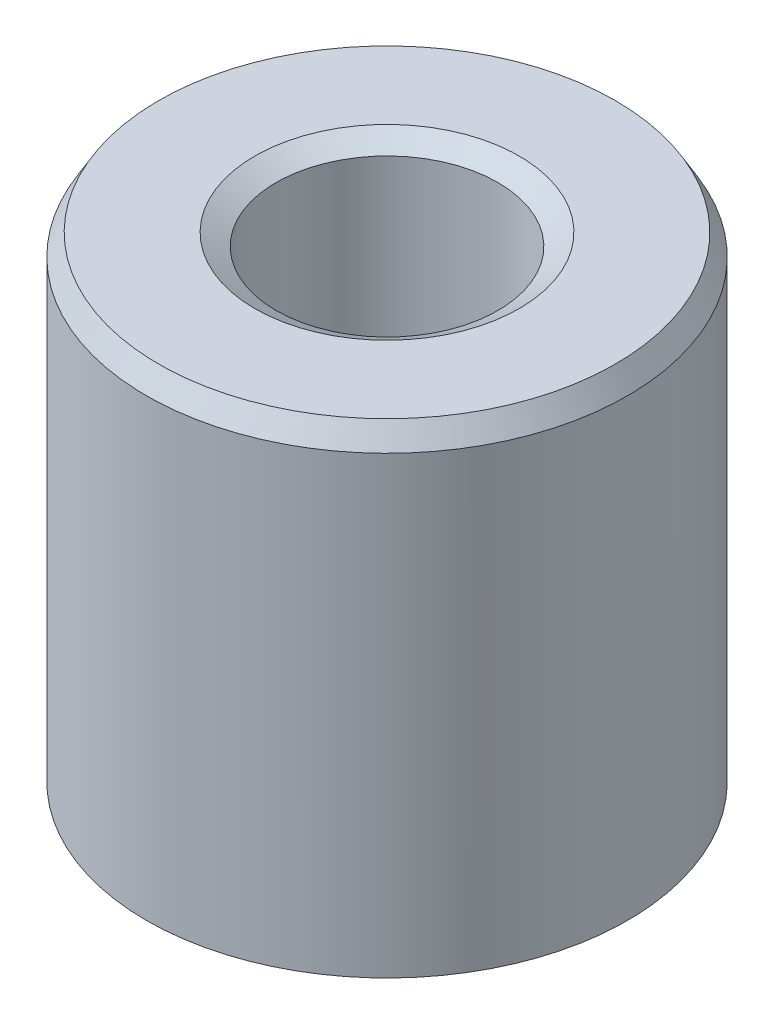
ISO-10303-21;
HEADER;
FILE_DESCRIPTION(('STEP AP214'),'2;1');
FILE_NAME('part.step','',(''),(''),'','','');
FILE_SCHEMA(('AUTOMOTIVE_DESIGN { 1 0 10303 214 1 1 1 1 }'));
ENDSEC;
DATA;
#1=APPLICATION_CONTEXT('core data for automotive mechanical design processes');
#2=APPLICATION_PROTOCOL_DEFINITION('international standard','automotive_design',2000,#1);
#3=PRODUCT_CONTEXT('',#1,'mechanical');
#4=PRODUCT('Part','Part','',(#3));
#5=PRODUCT_RELATED_PRODUCT_CATEGORY('part','',(#4));
#6=PRODUCT_DEFINITION_FORMATION('','',#4);
#7=PRODUCT_DEFINITION_CONTEXT('part definition',#1,'design');
#8=PRODUCT_DEFINITION('design','',#6,#7);
#9=PRODUCT_DEFINITION_SHAPE('','',#8);
#10=(LENGTH_UNIT() NAMED_UNIT(*) SI_UNIT(.MILLI.,.METRE.));
#11=(NAMED_UNIT(*) PLANE_ANGLE_UNIT() SI_UNIT($,.RADIAN.));
#12=(NAMED_UNIT(*) SI_UNIT($,.STERADIAN.) SOLID_ANGLE_UNIT());
#13=UNCERTAINTY_MEASURE_WITH_UNIT(LENGTH_MEASURE(1.E-05),#10,'distance_accuracy_value','');
#14=(GEOMETRIC_REPRESENTATION_CONTEXT(3) GLOBAL_UNCERTAINTY_ASSIGNED_CONTEXT((#13)) GLOBAL_UNIT_ASSIGNED_CONTEXT((#10,
#11,#12)) REPRESENTATION_CONTEXT('',''));
#15=CARTESIAN_POINT('',(0.,0.,0.));
#16=DIRECTION('',(0.,0.,1.));
#17=DIRECTION('',(1.,0.,0.));
#18=AXIS2_PLACEMENT_3D('',#15,#16,#17);
#19=CARTESIAN_POINT('',(0.,35.4954558521618,0.));
#20=DIRECTION('',(0.,-1.,0.));
#21=DIRECTION('',(0.,0.,-1.));
#22=AXIS2_PLACEMENT_3D('',#19,#20,#21);
#23=CYLINDRICAL_SURFACE('',#22,17.5);
#24=CARTESIAN_POINT('',(0.,0.893573718276391,0.));
#25=DIRECTION('',(0.,1.,0.));
#26=DIRECTION('',(0.,0.,1.));
#27=AXIS2_PLACEMENT_3D('',#24,#25,#26);
#28=CIRCLE('',#27,17.5);
#29=CARTESIAN_POINT('',(0.,0.893573718276391,17.5));
#30=VERTEX_POINT('',#29);
#31=EDGE_CURVE('E10',#30,#30,#28,.T.);
#32=ORIENTED_EDGE('',*,*,#31,.T.);
#33=EDGE_LOOP('',(#32));
#34=FACE_BOUND('',#33,.T.);
#35=CARTESIAN_POINT('',(0.,33.9477407717989,0.));
#36=DIRECTION('',(0.,1.,0.));
#37=DIRECTION('',(0.,0.,1.));
#38=AXIS2_PLACEMENT_3D('',#35,#36,#37);
#39=CIRCLE('',#38,17.5);
#40=CARTESIAN_POINT('',(0.,33.9477407717989,-17.5));
#41=VERTEX_POINT('',#40);
#42=EDGE_CURVE('E50',#41,#41,#39,.F.);
#43=ORIENTED_EDGE('',*,*,#42,.T.);
#44=EDGE_LOOP('',(#43));
#45=FACE_BOUND('',#44,.T.);
#46=ADVANCED_FACE('F39',(#34,#45),#23,.T.);
#47=CARTESIAN_POINT('',(0.,35.4954558521618,0.));
#48=DIRECTION('',(0.,1.,0.));
#49=DIRECTION('',(0.,0.,1.));
#50=AXIS2_PLACEMENT_3D('',#47,#48,#49);
#51=PLANE('',#50);
#52=CARTESIAN_POINT('',(0.,35.4954558521618,0.));
#53=DIRECTION('',(0.,1.,0.));
#54=DIRECTION('',(0.,0.,1.));
#55=AXIS2_PLACEMENT_3D('',#52,#53,#54);
#56=CIRCLE('',#55,9.61522943600847);
#57=CARTESIAN_POINT('',(0.,35.4954558521618,9.61522943600847));
#58=VERTEX_POINT('',#57);
#59=EDGE_CURVE('E58',#58,#58,#56,.F.);
#60=ORIENTED_EDGE('',*,*,#59,.T.);
#61=EDGE_LOOP('',(#60));
#62=FACE_BOUND('',#61,.T.);
#63=CARTESIAN_POINT('',(0.,35.4954558521618,0.));
#64=DIRECTION('',(0.,1.,0.));
#65=DIRECTION('',(0.,0.,1.));
#66=AXIS2_PLACEMENT_3D('',#63,#64,#65);
#67=CIRCLE('',#66,16.6064262817236);
#68=CARTESIAN_POINT('',(0.,35.4954558521618,-16.6064262817236));
#69=VERTEX_POINT('',#68);
#70=EDGE_CURVE('E61',#69,#69,#67,.T.);
#71=ORIENTED_EDGE('',*,*,#70,.T.);
#72=EDGE_LOOP('',(#71));
#73=FACE_BOUND('',#72,.T.);
#74=ADVANCED_FACE('F88',(#62,#73),#51,.T.);
#75=CARTESIAN_POINT('',(0.,0.,0.));
#76=DIRECTION('',(0.,1.,0.));
#77=DIRECTION('',(0.,0.,1.));
#78=AXIS2_PLACEMENT_3D('',#75,#76,#77);
#79=PLANE('',#78);
#80=CARTESIAN_POINT('',(0.,0.,0.));
#81=DIRECTION('',(0.,1.,0.));
#82=DIRECTION('',(0.,0.,1.));
#83=AXIS2_PLACEMENT_3D('',#80,#81,#82);
#84=CIRCLE('',#83,8.96108807392192);
#85=CARTESIAN_POINT('',(0.,0.,8.96108807392192));
#86=VERTEX_POINT('',#85);
#87=EDGE_CURVE('E51',#86,#86,#84,.T.);
#88=ORIENTED_EDGE('',*,*,#87,.T.);
#89=EDGE_LOOP('',(#88));
#90=FACE_BOUND('',#89,.T.);
#91=CARTESIAN_POINT('',(0.,0.,0.));
#92=DIRECTION('',(0.,1.,0.));
#93=DIRECTION('',(0.,0.,1.));
#94=AXIS2_PLACEMENT_3D('',#91,#92,#93);
#95=CIRCLE('',#94,15.952284919637);
#96=CARTESIAN_POINT('',(0.,0.,15.952284919637));
#97=VERTEX_POINT('',#96);
#98=EDGE_CURVE('E54',#97,#97,#95,.F.);
#99=ORIENTED_EDGE('',*,*,#98,.T.);
#100=EDGE_LOOP('',(#99));
#101=FACE_BOUND('',#100,.T.);
#102=ADVANCED_FACE('F83',(#90,#101),#79,.F.);
#103=CARTESIAN_POINT('',(0.,35.4954558521618,0.));
#104=DIRECTION('',(0.,-1.,0.));
#105=DIRECTION('',(0.,0.,-1.));
#106=AXIS2_PLACEMENT_3D('',#103,#104,#105);
#107=CYLINDRICAL_SURFACE('',#106,8.06751435564552);
#108=CARTESIAN_POINT('',(0.,34.6018821338855,0.));
#109=DIRECTION('',(0.,1.,0.));
#110=DIRECTION('',(0.,0.,1.));
#111=AXIS2_PLACEMENT_3D('',#108,#109,#110);
#112=CIRCLE('',#111,8.06751435564552);
#113=CARTESIAN_POINT('',(0.,34.6018821338855,8.06751435564552));
#114=VERTEX_POINT('',#113);
#115=EDGE_CURVE('E67',#114,#114,#112,.T.);
#116=ORIENTED_EDGE('',*,*,#115,.T.);
#117=EDGE_LOOP('',(#116));
#118=FACE_BOUND('',#117,.T.);
#119=CARTESIAN_POINT('',(0.,1.54771508036296,0.));
#120=DIRECTION('',(0.,1.,0.));
#121=DIRECTION('',(0.,0.,1.));
#122=AXIS2_PLACEMENT_3D('',#119,#120,#121);
#123=CIRCLE('',#122,8.06751435564552);
#124=CARTESIAN_POINT('',(0.,1.54771508036296,8.06751435564552));
#125=VERTEX_POINT('',#124);
#126=EDGE_CURVE('E69',#125,#125,#123,.F.);
#127=ORIENTED_EDGE('',*,*,#126,.T.);
#128=EDGE_LOOP('',(#127));
#129=FACE_BOUND('',#128,.T.);
#130=ADVANCED_FACE('F71',(#118,#129),#107,.F.);
#131=CARTESIAN_POINT('',(0.,34.6018821338855,0.));
#132=DIRECTION('',(0.,1.,0.));
#133=DIRECTION('',(0.,0.,1.));
#134=AXIS2_PLACEMENT_3D('',#131,#132,#133);
#135=CONICAL_SURFACE('',#134,8.06751435564552,1.04719755119661);
#136=ORIENTED_EDGE('',*,*,#59,.F.);
#137=EDGE_LOOP('',(#136));
#138=FACE_BOUND('',#137,.T.);
#139=ORIENTED_EDGE('',*,*,#115,.F.);
#140=EDGE_LOOP('',(#139));
#141=FACE_BOUND('',#140,.T.);
#142=ADVANCED_FACE('F77',(#138,#141),#135,.F.);
#143=CARTESIAN_POINT('',(0.,0.,0.));
#144=DIRECTION('',(0.,-1.,0.));
#145=DIRECTION('',(0.,0.,-1.));
#146=AXIS2_PLACEMENT_3D('',#143,#144,#145);
#147=CONICAL_SURFACE('',#146,8.96108807392192,0.523598775598296);
#148=ORIENTED_EDGE('',*,*,#126,.F.);
#149=EDGE_LOOP('',(#148));
#150=FACE_BOUND('',#149,.T.);
#151=ORIENTED_EDGE('',*,*,#87,.F.);
#152=EDGE_LOOP('',(#151));
#153=FACE_BOUND('',#152,.T.);
#154=ADVANCED_FACE('F73',(#150,#153),#147,.F.);
#155=CARTESIAN_POINT('',(0.,0.893573718276391,0.));
#156=DIRECTION('',(0.,1.,0.));
#157=DIRECTION('',(0.,0.,1.));
#158=AXIS2_PLACEMENT_3D('',#155,#156,#157);
#159=CONICAL_SURFACE('',#158,17.5,1.0471975511966);
#160=ORIENTED_EDGE('',*,*,#98,.F.);
#161=EDGE_LOOP('',(#160));
#162=FACE_BOUND('',#161,.T.);
#163=ORIENTED_EDGE('',*,*,#31,.F.);
#164=EDGE_LOOP('',(#163));
#165=FACE_BOUND('',#164,.T.);
#166=ADVANCED_FACE('F76',(#162,#165),#159,.T.);
#167=CARTESIAN_POINT('',(0.,35.4954558521618,0.));
#168=DIRECTION('',(0.,-1.,0.));
#169=DIRECTION('',(0.,0.,-1.));
#170=AXIS2_PLACEMENT_3D('',#167,#168,#169);
#171=CONICAL_SURFACE('',#170,16.6064262817236,0.523598775598299);
#172=CARTESIAN_POINT('',(0.,33.9477407717989,-17.5));
#173=CARTESIAN_POINT('',(0.,33.963862803886,-17.4906919404346));
#174=CARTESIAN_POINT('',(0.,33.9799848359731,-17.4813838808692));
#175=CARTESIAN_POINT('',(0.,34.0122289001473,-17.4627677617385));
#176=CARTESIAN_POINT('',(0.,34.0283509322344,-17.4534597021731));
#177=CARTESIAN_POINT('',(0.,34.0605949964087,-17.4348435830424));
#178=CARTESIAN_POINT('',(0.,34.0767170284958,-17.425535523477));
#179=CARTESIAN_POINT('',(0.,34.10896109267,-17.4069194043462));
#180=CARTESIAN_POINT('',(0.,34.1250831247571,-17.3976113447808));
#181=CARTESIAN_POINT('',(0.,34.1573271889313,-17.3789952256501));
#182=CARTESIAN_POINT('',(0.,34.1734492210185,-17.3696871660847));
#183=CARTESIAN_POINT('',(0.,34.2056932851927,-17.3510710469539));
#184=CARTESIAN_POINT('',(0.,34.2218153172798,-17.3417629873886));
#185=CARTESIAN_POINT('',(0.,34.254059381454,-17.3231468682578));
#186=CARTESIAN_POINT('',(0.,34.2701814135412,-17.3138388086924));
#187=CARTESIAN_POINT('',(0.,34.3024254777154,-17.2952226895617));
#188=CARTESIAN_POINT('',(0.,34.3185475098025,-17.2859146299963));
#189=CARTESIAN_POINT('',(0.,34.3507915739767,-17.2672985108655));
#190=CARTESIAN_POINT('',(0.,34.3669136060638,-17.2579904513001));
#191=CARTESIAN_POINT('',(0.,34.3991576702381,-17.2393743321694));
#192=CARTESIAN_POINT('',(0.,34.4152797023252,-17.230066272604));
#193=CARTESIAN_POINT('',(0.,34.4475237664994,-17.2114501534733));
#194=CARTESIAN_POINT('',(0.,34.4636457985865,-17.2021420939079));
#195=CARTESIAN_POINT('',(0.,34.4958898627608,-17.1835259747771));
#196=CARTESIAN_POINT('',(0.,34.5120118948479,-17.1742179152117));
#197=CARTESIAN_POINT('',(0.,34.5442559590221,-17.155601796081));
#198=CARTESIAN_POINT('',(0.,34.5603779911092,-17.1462937365156));
#199=CARTESIAN_POINT('',(0.,34.5926220552834,-17.1276776173848));
#200=CARTESIAN_POINT('',(0.,34.6087440873706,-17.1183695578195));
#201=CARTESIAN_POINT('',(0.,34.6409881515448,-17.0997534386887));
#202=CARTESIAN_POINT('',(0.,34.6571101836319,-17.0904453791233));
#203=CARTESIAN_POINT('',(0.,34.6893542478061,-17.0718292599926));
#204=CARTESIAN_POINT('',(0.,34.7054762798932,-17.0625212004272));
#205=CARTESIAN_POINT('',(0.,34.7377203440675,-17.0439050812964));
#206=CARTESIAN_POINT('',(0.,34.7538423761546,-17.034597021731));
#207=CARTESIAN_POINT('',(0.,34.7860864403288,-17.0159809026003));
#208=CARTESIAN_POINT('',(0.,34.8022084724159,-17.0066728430349));
#209=CARTESIAN_POINT('',(0.,34.8344525365901,-16.9880567239042));
#210=CARTESIAN_POINT('',(0.,34.8505745686773,-16.9787486643388));
#211=CARTESIAN_POINT('',(0.,34.8828186328515,-16.960132545208));
#212=CARTESIAN_POINT('',(0.,34.8989406649386,-16.9508244856426));
#213=CARTESIAN_POINT('',(0.,34.9311847291128,-16.9322083665119));
#214=CARTESIAN_POINT('',(0.,34.9473067611999,-16.9229003069465));
#215=CARTESIAN_POINT('',(0.,34.9795508253742,-16.9042841878157));
#216=CARTESIAN_POINT('',(0.,34.9956728574613,-16.8949761282504));
#217=CARTESIAN_POINT('',(0.,35.0279169216355,-16.8763600091196));
#218=CARTESIAN_POINT('',(0.,35.0440389537226,-16.8670519495542));
#219=CARTESIAN_POINT('',(0.,35.0762830178969,-16.8484358304235));
#220=CARTESIAN_POINT('',(0.,35.092405049984,-16.8391277708581));
#221=CARTESIAN_POINT('',(0.,35.1246491141582,-16.8205116517273));
#222=CARTESIAN_POINT('',(0.,35.1407711462453,-16.8112035921619));
#223=CARTESIAN_POINT('',(0.,35.1730152104195,-16.7925874730312));
#224=CARTESIAN_POINT('',(0.,35.1891372425067,-16.7832794134658));
#225=CARTESIAN_POINT('',(0.,35.2213813066809,-16.7646632943351));
#226=CARTESIAN_POINT('',(0.,35.237503338768,-16.7553552347697));
#227=CARTESIAN_POINT('',(0.,35.2697474029422,-16.7367391156389));
#228=CARTESIAN_POINT('',(0.,35.2858694350293,-16.7274310560735));
#229=CARTESIAN_POINT('',(0.,35.3181134992036,-16.7088149369428));
#230=CARTESIAN_POINT('',(0.,35.3342355312907,-16.6995068773774));
#231=CARTESIAN_POINT('',(0.,35.3664795954649,-16.6808907582466));
#232=CARTESIAN_POINT('',(0.,35.382601627552,-16.6715826986813));
#233=CARTESIAN_POINT('',(0.,35.4148456917263,-16.6529665795505));
#234=CARTESIAN_POINT('',(0.,35.4309677238134,-16.6436585199851));
#235=CARTESIAN_POINT('',(0.,35.4632117879876,-16.6250424008544));
#236=CARTESIAN_POINT('',(0.,35.4793338200747,-16.615734341289));
#237=CARTESIAN_POINT('',(0.,35.4954558521618,-16.6064262817236));
#238=B_SPLINE_CURVE_WITH_KNOTS('',3,(#172,#173,#174,#175,#176,#177,#178,#179,#180,#181,#182,
#183,#184,#185,#186,#187,#188,#189,#190,#191,#192,#193,#194,#195,#196,#197,#198,#199,#200,#201,
#202,#203,#204,#205,#206,#207,#208,#209,#210,#211,#212,#213,#214,#215,#216,#217,#218,#219,#220,
#221,#222,#223,#224,#225,#226,#227,#228,#229,#230,#231,#232,#233,#234,#235,#236,#237),
.UNSPECIFIED.,.F.,.F.,(4,2,2,2,2,2,2,2,2,2,2,2,2,2,2,2,2,2,2,2,2,2,2,2,2,2,2,2,2,2,2,2,4),(0.,
0.0558483573922741,0.111696714784547,0.167545072176825,0.223393429569099,0.279241786961372,
0.33509014435365,0.390938501745924,0.446786859138196,0.502635216530477,0.558483573922749,
0.614331931315021,0.670180288707302,0.726028646099574,0.781877003491846,0.837725360884126,
0.893573718276399,0.949422075668671,1.00527043306095,1.06111879045322,1.1169671478455,
1.17281550523778,1.22866386263005,1.28451222002232,1.3403605774146,1.39620893480687,
1.45205729219915,1.50790564959143,1.5637540069837,1.61960236437597,1.67545072176825,
1.73129907916052,1.7871474365528),.UNSPECIFIED.);
#239=EDGE_CURVE('BSEAM45',#41,#69,#238,.T.);
#240=ORIENTED_EDGE('',*,*,#42,.F.);
#241=ORIENTED_EDGE('',*,*,#70,.F.);
#242=ORIENTED_EDGE('',*,*,#239,.T.);
#243=ORIENTED_EDGE('',*,*,#239,.F.);
#244=EDGE_LOOP('',(#240,#242,#241,#243));
#245=FACE_BOUND('',#244,.T.);
#246=ADVANCED_FACE('F45',(#245),#171,.T.);
#247=CLOSED_SHELL('',(#46,#74,#102,#130,#142,#154,#166,#246));
#248=MANIFOLD_SOLID_BREP('B2',#247);
#249=ADVANCED_BREP_SHAPE_REPRESENTATION('',(#18,#248),#14);
#250=SHAPE_DEFINITION_REPRESENTATION(#9,#249);
ENDSEC;
END-ISO-10303-21;
